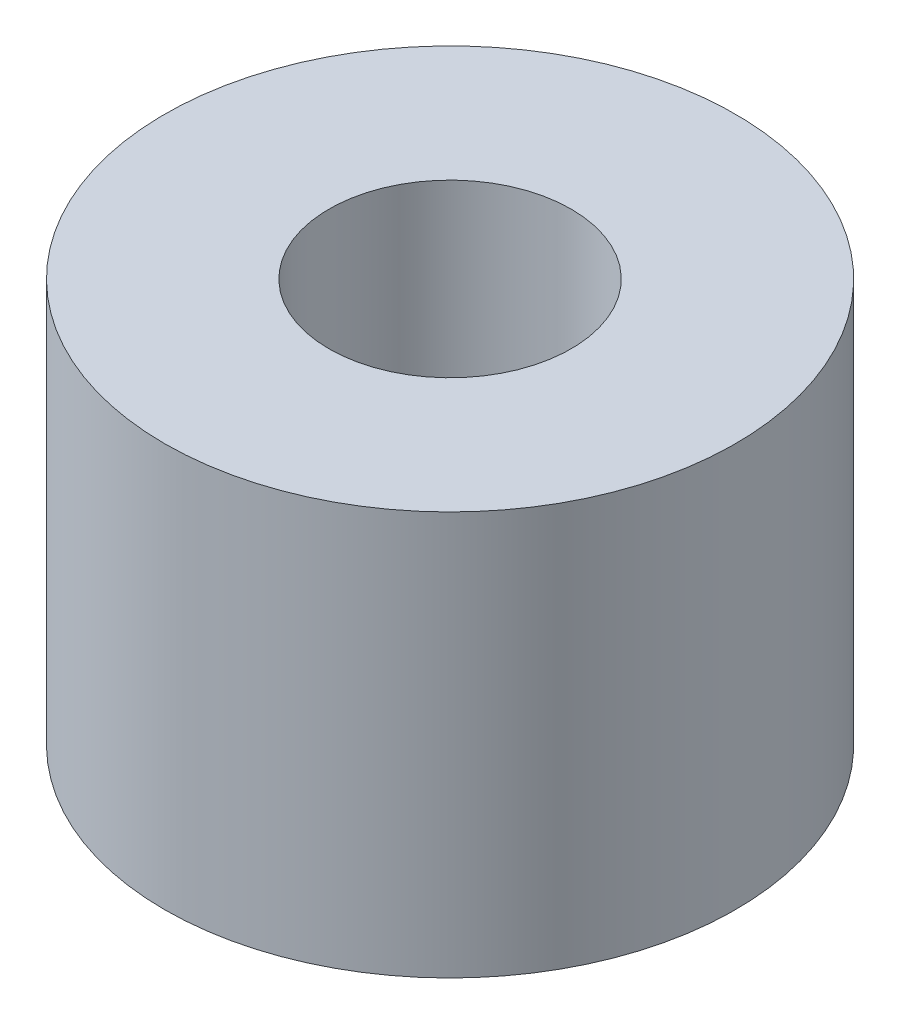
ISO-10303-21;
HEADER;
FILE_DESCRIPTION(('STEP AP214'),'2;1');
FILE_NAME('part.step','',(''),(''),'','','');
FILE_SCHEMA(('AUTOMOTIVE_DESIGN { 1 0 10303 214 1 1 1 1 }'));
ENDSEC;
DATA;
#1=APPLICATION_CONTEXT('core data for automotive mechanical design processes');
#2=APPLICATION_PROTOCOL_DEFINITION('international standard','automotive_design',2000,#1);
#3=PRODUCT_CONTEXT('',#1,'mechanical');
#4=PRODUCT('Part','Part','',(#3));
#5=PRODUCT_RELATED_PRODUCT_CATEGORY('part','',(#4));
#6=PRODUCT_DEFINITION_FORMATION('','',#4);
#7=PRODUCT_DEFINITION_CONTEXT('part definition',#1,'design');
#8=PRODUCT_DEFINITION('design','',#6,#7);
#9=PRODUCT_DEFINITION_SHAPE('','',#8);
#10=(LENGTH_UNIT() NAMED_UNIT(*) SI_UNIT(.MILLI.,.METRE.));
#11=(NAMED_UNIT(*) PLANE_ANGLE_UNIT() SI_UNIT($,.RADIAN.));
#12=(NAMED_UNIT(*) SI_UNIT($,.STERADIAN.) SOLID_ANGLE_UNIT());
#13=UNCERTAINTY_MEASURE_WITH_UNIT(LENGTH_MEASURE(1.E-05),#10,'distance_accuracy_value','');
#14=(GEOMETRIC_REPRESENTATION_CONTEXT(3) GLOBAL_UNCERTAINTY_ASSIGNED_CONTEXT((#13)) GLOBAL_UNIT_ASSIGNED_CONTEXT((#10,
#11,#12)) REPRESENTATION_CONTEXT('',''));
#15=CARTESIAN_POINT('',(0.,0.,0.));
#16=DIRECTION('',(0.,0.,1.));
#17=DIRECTION('',(1.,0.,0.));
#18=AXIS2_PLACEMENT_3D('',#15,#16,#17);
#19=CARTESIAN_POINT('',(0.,5.,0.));
#20=DIRECTION('',(0.,1.,0.));
#21=DIRECTION('',(0.,0.,1.));
#22=AXIS2_PLACEMENT_3D('',#19,#20,#21);
#23=PLANE('',#22);
#24=CARTESIAN_POINT('',(0.,5.,0.));
#25=DIRECTION('',(0.,1.,0.));
#26=DIRECTION('',(0.,0.,1.));
#27=AXIS2_PLACEMENT_3D('',#24,#25,#26);
#28=CIRCLE('',#27,3.53553390593275);
#29=CARTESIAN_POINT('',(0.,5.,3.53553390593275));
#30=VERTEX_POINT('',#29);
#31=EDGE_CURVE('E10',#30,#30,#28,.T.);
#32=ORIENTED_EDGE('',*,*,#31,.T.);
#33=EDGE_LOOP('',(#32));
#34=FACE_BOUND('',#33,.T.);
#35=CARTESIAN_POINT('',(0.,5.,0.));
#36=DIRECTION('',(0.,1.,0.));
#37=DIRECTION('',(0.,0.,1.));
#38=AXIS2_PLACEMENT_3D('',#35,#36,#37);
#39=CIRCLE('',#38,1.5);
#40=CARTESIAN_POINT('',(0.,5.,1.5));
#41=VERTEX_POINT('',#40);
#42=EDGE_CURVE('E45',#41,#41,#39,.T.);
#43=ORIENTED_EDGE('',*,*,#42,.F.);
#44=EDGE_LOOP('',(#43));
#45=FACE_BOUND('',#44,.T.);
#46=ADVANCED_FACE('F34',(#34,#45),#23,.T.);
#47=CARTESIAN_POINT('',(0.,0.,0.));
#48=DIRECTION('',(0.,1.,0.));
#49=DIRECTION('',(0.,0.,1.));
#50=AXIS2_PLACEMENT_3D('',#47,#48,#49);
#51=PLANE('',#50);
#52=CARTESIAN_POINT('',(0.,0.,0.));
#53=DIRECTION('',(0.,1.,0.));
#54=DIRECTION('',(0.,0.,1.));
#55=AXIS2_PLACEMENT_3D('',#52,#53,#54);
#56=CIRCLE('',#55,3.53553390593275);
#57=CARTESIAN_POINT('',(0.,0.,3.53553390593275));
#58=VERTEX_POINT('',#57);
#59=EDGE_CURVE('E38',#58,#58,#56,.T.);
#60=ORIENTED_EDGE('',*,*,#59,.F.);
#61=EDGE_LOOP('',(#60));
#62=FACE_BOUND('',#61,.T.);
#63=CARTESIAN_POINT('',(0.,0.,0.));
#64=DIRECTION('',(0.,1.,0.));
#65=DIRECTION('',(0.,0.,1.));
#66=AXIS2_PLACEMENT_3D('',#63,#64,#65);
#67=CIRCLE('',#66,1.5);
#68=CARTESIAN_POINT('',(0.,0.,1.5));
#69=VERTEX_POINT('',#68);
#70=EDGE_CURVE('E47',#69,#69,#67,.T.);
#71=ORIENTED_EDGE('',*,*,#70,.T.);
#72=EDGE_LOOP('',(#71));
#73=FACE_BOUND('',#72,.T.);
#74=ADVANCED_FACE('F57',(#62,#73),#51,.F.);
#75=CARTESIAN_POINT('',(0.,5.,0.));
#76=DIRECTION('',(0.,-1.,0.));
#77=DIRECTION('',(0.,0.,-1.));
#78=AXIS2_PLACEMENT_3D('',#75,#76,#77);
#79=CYLINDRICAL_SURFACE('',#78,3.53553390593275);
#80=ORIENTED_EDGE('',*,*,#31,.F.);
#81=EDGE_LOOP('',(#80));
#82=FACE_BOUND('',#81,.T.);
#83=ORIENTED_EDGE('',*,*,#59,.T.);
#84=EDGE_LOOP('',(#83));
#85=FACE_BOUND('',#84,.T.);
#86=ADVANCED_FACE('F36',(#82,#85),#79,.T.);
#87=CARTESIAN_POINT('',(0.,5.,0.));
#88=DIRECTION('',(0.,-1.,0.));
#89=DIRECTION('',(0.,0.,-1.));
#90=AXIS2_PLACEMENT_3D('',#87,#88,#89);
#91=CYLINDRICAL_SURFACE('',#90,1.5);
#92=ORIENTED_EDGE('',*,*,#42,.T.);
#93=EDGE_LOOP('',(#92));
#94=FACE_BOUND('',#93,.T.);
#95=ORIENTED_EDGE('',*,*,#70,.F.);
#96=EDGE_LOOP('',(#95));
#97=FACE_BOUND('',#96,.T.);
#98=ADVANCED_FACE('F53',(#94,#97),#91,.F.);
#99=CLOSED_SHELL('',(#46,#74,#86,#98));
#100=MANIFOLD_SOLID_BREP('B2',#99);
#101=ADVANCED_BREP_SHAPE_REPRESENTATION('',(#18,#100),#14);
#102=SHAPE_DEFINITION_REPRESENTATION(#9,#101);
ENDSEC;
END-ISO-10303-21;
